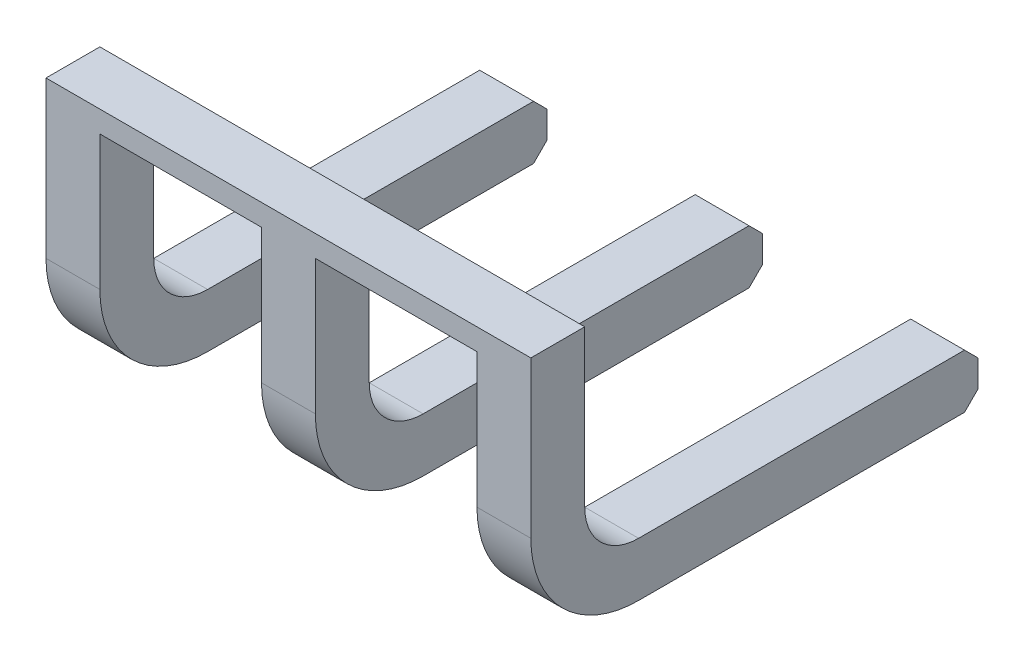
ISO-10303-21;
HEADER;
FILE_DESCRIPTION(('STEP AP214'),'2;1');
FILE_NAME('part.step','',(''),(''),'','','');
FILE_SCHEMA(('AUTOMOTIVE_DESIGN { 1 0 10303 214 1 1 1 1 }'));
ENDSEC;
DATA;
#1=APPLICATION_CONTEXT('core data for automotive mechanical design processes');
#2=APPLICATION_PROTOCOL_DEFINITION('international standard','automotive_design',2000,#1);
#3=PRODUCT_CONTEXT('',#1,'mechanical');
#4=PRODUCT('Part','Part','',(#3));
#5=PRODUCT_RELATED_PRODUCT_CATEGORY('part','',(#4));
#6=PRODUCT_DEFINITION_FORMATION('','',#4);
#7=PRODUCT_DEFINITION_CONTEXT('part definition',#1,'design');
#8=PRODUCT_DEFINITION('design','',#6,#7);
#9=PRODUCT_DEFINITION_SHAPE('','',#8);
#10=(LENGTH_UNIT() NAMED_UNIT(*) SI_UNIT(.MILLI.,.METRE.));
#11=(NAMED_UNIT(*) PLANE_ANGLE_UNIT() SI_UNIT($,.RADIAN.));
#12=(NAMED_UNIT(*) SI_UNIT($,.STERADIAN.) SOLID_ANGLE_UNIT());
#13=UNCERTAINTY_MEASURE_WITH_UNIT(LENGTH_MEASURE(1.E-05),#10,'distance_accuracy_value','');
#14=(GEOMETRIC_REPRESENTATION_CONTEXT(3) GLOBAL_UNCERTAINTY_ASSIGNED_CONTEXT((#13)) GLOBAL_UNIT_ASSIGNED_CONTEXT((#10,
#11,#12)) REPRESENTATION_CONTEXT('',''));
#15=CARTESIAN_POINT('',(0.,0.,0.));
#16=DIRECTION('',(0.,0.,1.));
#17=DIRECTION('',(1.,0.,0.));
#18=AXIS2_PLACEMENT_3D('',#15,#16,#17);
#19=CARTESIAN_POINT('',(2.8575,-0.5715,0.0635));
#20=DIRECTION('',(0.,0.,1.));
#21=DIRECTION('',(0.,1.,0.));
#22=AXIS2_PLACEMENT_3D('',#19,#20,#21);
#23=PLANE('',#22);
#24=DIRECTION('',(-1.,0.,0.));
#25=VECTOR('',#24,1.);
#26=CARTESIAN_POINT('',(2.8575,1.27000000000001,0.0635));
#27=LINE('',#26,#25);
#28=CARTESIAN_POINT('',(-2.8575,1.27000000000001,0.0635));
#29=VERTEX_POINT('',#28);
#30=CARTESIAN_POINT('',(2.8575,1.27000000000001,0.0635));
#31=VERTEX_POINT('',#30);
#32=EDGE_CURVE('E215',#29,#31,#27,.F.);
#33=ORIENTED_EDGE('',*,*,#32,.F.);
#34=DIRECTION('',(0.,-1.,0.));
#35=VECTOR('',#34,1.);
#36=CARTESIAN_POINT('',(-2.8575,1.27000000000001,0.0635));
#37=LINE('',#36,#35);
#38=CARTESIAN_POINT('',(-2.8575,-0.5715,0.0635));
#39=VERTEX_POINT('',#38);
#40=EDGE_CURVE('E230',#29,#39,#37,.T.);
#41=ORIENTED_EDGE('',*,*,#40,.T.);
#42=DIRECTION('',(1.,0.,0.));
#43=VECTOR('',#42,1.);
#44=CARTESIAN_POINT('',(-2.8575,-0.5715,0.0635));
#45=LINE('',#44,#43);
#46=CARTESIAN_POINT('',(-2.2225,-0.571499999999984,0.0635));
#47=VERTEX_POINT('',#46);
#48=EDGE_CURVE('E240',#47,#39,#45,.F.);
#49=ORIENTED_EDGE('',*,*,#48,.F.);
#50=DIRECTION('',(0.,1.,0.));
#51=VECTOR('',#50,1.);
#52=CARTESIAN_POINT('',(-2.2225,-0.571499999999984,0.0635));
#53=LINE('',#52,#51);
#54=CARTESIAN_POINT('',(-2.2225,1.016,0.0635));
#55=VERTEX_POINT('',#54);
#56=EDGE_CURVE('E242',#55,#47,#53,.F.);
#57=ORIENTED_EDGE('',*,*,#56,.F.);
#58=DIRECTION('',(1.,0.,0.));
#59=VECTOR('',#58,1.);
#60=CARTESIAN_POINT('',(-2.2225,1.016,0.0635));
#61=LINE('',#60,#59);
#62=CARTESIAN_POINT('',(-0.3175,1.016,0.0635));
#63=VERTEX_POINT('',#62);
#64=EDGE_CURVE('E252',#63,#55,#61,.F.);
#65=ORIENTED_EDGE('',*,*,#64,.F.);
#66=DIRECTION('',(0.,-1.,0.));
#67=VECTOR('',#66,1.);
#68=CARTESIAN_POINT('',(-0.3175,1.016,0.0635));
#69=LINE('',#68,#67);
#70=CARTESIAN_POINT('',(-0.3175,-0.57149999999997,0.0635));
#71=VERTEX_POINT('',#70);
#72=EDGE_CURVE('E256',#71,#63,#69,.F.);
#73=ORIENTED_EDGE('',*,*,#72,.F.);
#74=DIRECTION('',(1.,0.,0.));
#75=VECTOR('',#74,1.);
#76=CARTESIAN_POINT('',(-0.3175,-0.57149999999997,0.0635));
#77=LINE('',#76,#75);
#78=CARTESIAN_POINT('',(0.3175,-0.571499999999984,0.0635));
#79=VERTEX_POINT('',#78);
#80=EDGE_CURVE('E260',#79,#71,#77,.F.);
#81=ORIENTED_EDGE('',*,*,#80,.F.);
#82=DIRECTION('',(0.,1.,0.));
#83=VECTOR('',#82,1.);
#84=CARTESIAN_POINT('',(0.3175,-0.571499999999984,0.0635));
#85=LINE('',#84,#83);
#86=CARTESIAN_POINT('',(0.3175,1.016,0.0635));
#87=VERTEX_POINT('',#86);
#88=EDGE_CURVE('E265',#87,#79,#85,.F.);
#89=ORIENTED_EDGE('',*,*,#88,.F.);
#90=DIRECTION('',(1.,0.,0.));
#91=VECTOR('',#90,1.);
#92=CARTESIAN_POINT('',(0.3175,1.016,0.0635));
#93=LINE('',#92,#91);
#94=CARTESIAN_POINT('',(2.2225,1.016,0.0635));
#95=VERTEX_POINT('',#94);
#96=EDGE_CURVE('E269',#95,#87,#93,.F.);
#97=ORIENTED_EDGE('',*,*,#96,.F.);
#98=DIRECTION('',(0.,-1.,0.));
#99=VECTOR('',#98,1.);
#100=CARTESIAN_POINT('',(2.2225,1.016,0.0635));
#101=LINE('',#100,#99);
#102=CARTESIAN_POINT('',(2.2225,-0.57149999999997,0.0635));
#103=VERTEX_POINT('',#102);
#104=EDGE_CURVE('E274',#103,#95,#101,.F.);
#105=ORIENTED_EDGE('',*,*,#104,.F.);
#106=DIRECTION('',(1.,0.,0.));
#107=VECTOR('',#106,1.);
#108=CARTESIAN_POINT('',(2.2225,-0.57149999999997,0.0635));
#109=LINE('',#108,#107);
#110=CARTESIAN_POINT('',(2.8575,-0.571499999999984,0.0635));
#111=VERTEX_POINT('',#110);
#112=EDGE_CURVE('E279',#111,#103,#109,.F.);
#113=ORIENTED_EDGE('',*,*,#112,.F.);
#114=DIRECTION('',(0.,1.,0.));
#115=VECTOR('',#114,1.);
#116=CARTESIAN_POINT('',(2.8575,-0.571499999999984,0.0635));
#117=LINE('',#116,#115);
#118=EDGE_CURVE('E233',#31,#111,#117,.F.);
#119=ORIENTED_EDGE('',*,*,#118,.F.);
#120=EDGE_LOOP('',(#33,#41,#49,#57,#65,#73,#81,#89,#97,#105,#113,#119));
#121=FACE_BOUND('',#120,.T.);
#122=ADVANCED_FACE('F16',(#121),#23,.T.);
#123=CARTESIAN_POINT('',(-2.8575,-0.571500000000014,-0.5715));
#124=DIRECTION('',(0.,0.,-1.));
#125=DIRECTION('',(0.,1.,0.));
#126=AXIS2_PLACEMENT_3D('',#123,#124,#125);
#127=PLANE('',#126);
#128=DIRECTION('',(1.,0.,0.));
#129=VECTOR('',#128,1.);
#130=CARTESIAN_POINT('',(-2.8575,1.27000000000001,-0.5715));
#131=LINE('',#130,#129);
#132=CARTESIAN_POINT('',(2.8575,1.27000000000001,-0.5715));
#133=VERTEX_POINT('',#132);
#134=CARTESIAN_POINT('',(-2.8575,1.27000000000001,-0.5715));
#135=VERTEX_POINT('',#134);
#136=EDGE_CURVE('E218',#133,#135,#131,.F.);
#137=ORIENTED_EDGE('',*,*,#136,.F.);
#138=DIRECTION('',(0.,-1.,0.));
#139=VECTOR('',#138,1.);
#140=CARTESIAN_POINT('',(2.8575,1.27000000000001,-0.5715));
#141=LINE('',#140,#139);
#142=CARTESIAN_POINT('',(2.8575,-0.5715,-0.5715));
#143=VERTEX_POINT('',#142);
#144=EDGE_CURVE('E290',#143,#133,#141,.F.);
#145=ORIENTED_EDGE('',*,*,#144,.F.);
#146=DIRECTION('',(-1.,0.,0.));
#147=VECTOR('',#146,1.);
#148=CARTESIAN_POINT('',(2.8575,-0.5715,-0.5715));
#149=LINE('',#148,#147);
#150=CARTESIAN_POINT('',(2.2225,-0.571500000000014,-0.5715));
#151=VERTEX_POINT('',#150);
#152=EDGE_CURVE('E295',#143,#151,#149,.T.);
#153=ORIENTED_EDGE('',*,*,#152,.T.);
#154=DIRECTION('',(0.,1.,0.));
#155=VECTOR('',#154,1.);
#156=CARTESIAN_POINT('',(2.2225,-0.571500000000014,-0.5715));
#157=LINE('',#156,#155);
#158=CARTESIAN_POINT('',(2.2225,1.016,-0.5715));
#159=VERTEX_POINT('',#158);
#160=EDGE_CURVE('E300',#159,#151,#157,.F.);
#161=ORIENTED_EDGE('',*,*,#160,.F.);
#162=DIRECTION('',(-1.,0.,0.));
#163=VECTOR('',#162,1.);
#164=CARTESIAN_POINT('',(2.2225,1.016,-0.5715));
#165=LINE('',#164,#163);
#166=CARTESIAN_POINT('',(0.3175,1.016,-0.5715));
#167=VERTEX_POINT('',#166);
#168=EDGE_CURVE('E304',#167,#159,#165,.F.);
#169=ORIENTED_EDGE('',*,*,#168,.F.);
#170=DIRECTION('',(0.,-1.,0.));
#171=VECTOR('',#170,1.);
#172=CARTESIAN_POINT('',(0.3175,1.016,-0.5715));
#173=LINE('',#172,#171);
#174=CARTESIAN_POINT('',(0.3175,-0.5715,-0.5715));
#175=VERTEX_POINT('',#174);
#176=EDGE_CURVE('E308',#175,#167,#173,.F.);
#177=ORIENTED_EDGE('',*,*,#176,.F.);
#178=DIRECTION('',(-1.,0.,0.));
#179=VECTOR('',#178,1.);
#180=CARTESIAN_POINT('',(0.3175,-0.5715,-0.5715));
#181=LINE('',#180,#179);
#182=CARTESIAN_POINT('',(-0.3175,-0.571500000000013,-0.5715));
#183=VERTEX_POINT('',#182);
#184=EDGE_CURVE('E312',#175,#183,#181,.T.);
#185=ORIENTED_EDGE('',*,*,#184,.T.);
#186=DIRECTION('',(0.,1.,0.));
#187=VECTOR('',#186,1.);
#188=CARTESIAN_POINT('',(-0.3175,-0.571500000000013,-0.5715));
#189=LINE('',#188,#187);
#190=CARTESIAN_POINT('',(-0.3175,1.016,-0.5715));
#191=VERTEX_POINT('',#190);
#192=EDGE_CURVE('E317',#191,#183,#189,.F.);
#193=ORIENTED_EDGE('',*,*,#192,.F.);
#194=DIRECTION('',(-1.,0.,0.));
#195=VECTOR('',#194,1.);
#196=CARTESIAN_POINT('',(-0.3175,1.016,-0.5715));
#197=LINE('',#196,#195);
#198=CARTESIAN_POINT('',(-2.2225,1.016,-0.5715));
#199=VERTEX_POINT('',#198);
#200=EDGE_CURVE('E321',#199,#191,#197,.F.);
#201=ORIENTED_EDGE('',*,*,#200,.F.);
#202=DIRECTION('',(0.,-1.,0.));
#203=VECTOR('',#202,1.);
#204=CARTESIAN_POINT('',(-2.2225,1.016,-0.5715));
#205=LINE('',#204,#203);
#206=CARTESIAN_POINT('',(-2.2225,-0.5715,-0.5715));
#207=VERTEX_POINT('',#206);
#208=EDGE_CURVE('E326',#207,#199,#205,.F.);
#209=ORIENTED_EDGE('',*,*,#208,.F.);
#210=DIRECTION('',(-1.,0.,0.));
#211=VECTOR('',#210,1.);
#212=CARTESIAN_POINT('',(-2.2225,-0.5715,-0.5715));
#213=LINE('',#212,#211);
#214=CARTESIAN_POINT('',(-2.8575,-0.571500000000013,-0.5715));
#215=VERTEX_POINT('',#214);
#216=EDGE_CURVE('E331',#207,#215,#213,.T.);
#217=ORIENTED_EDGE('',*,*,#216,.T.);
#218=DIRECTION('',(0.,1.,0.));
#219=VECTOR('',#218,1.);
#220=CARTESIAN_POINT('',(-2.8575,-0.571500000000013,-0.5715));
#221=LINE('',#220,#219);
#222=EDGE_CURVE('E336',#215,#135,#221,.T.);
#223=ORIENTED_EDGE('',*,*,#222,.T.);
#224=EDGE_LOOP('',(#137,#145,#153,#161,#169,#177,#185,#193,#201,#209,#217,#223));
#225=FACE_BOUND('',#224,.T.);
#226=ADVANCED_FACE('F632',(#225),#127,.T.);
#227=CARTESIAN_POINT('',(2.8575,-1.8415,0.0635000000000001));
#228=DIRECTION('',(1.,0.,0.));
#229=DIRECTION('',(0.,0.,-1.));
#230=AXIS2_PLACEMENT_3D('',#227,#228,#229);
#231=PLANE('',#230);
#232=ORIENTED_EDGE('',*,*,#144,.T.);
#233=DIRECTION('',(0.,0.,1.));
#234=VECTOR('',#233,1.);
#235=CARTESIAN_POINT('',(2.8575,1.27000000000001,-0.571499999999993));
#236=LINE('',#235,#234);
#237=EDGE_CURVE('E340',#133,#31,#236,.T.);
#238=ORIENTED_EDGE('',*,*,#237,.T.);
#239=ORIENTED_EDGE('',*,*,#118,.T.);
#240=CARTESIAN_POINT('',(2.8575,-0.571499999999968,-1.20650000000003));
#241=DIRECTION('',(1.,0.,0.));
#242=DIRECTION('',(0.,0.,1.));
#243=AXIS2_PLACEMENT_3D('',#240,#241,#242);
#244=CIRCLE('',#243,1.27000000000003);
#245=CARTESIAN_POINT('',(2.8575,-1.8415,-1.2065));
#246=VERTEX_POINT('',#245);
#247=EDGE_CURVE('E344',#111,#246,#244,.T.);
#248=ORIENTED_EDGE('',*,*,#247,.T.);
#249=DIRECTION('',(0.,0.,-1.));
#250=VECTOR('',#249,1.);
#251=CARTESIAN_POINT('',(2.8575,-1.8415,-1.2065));
#252=LINE('',#251,#250);
#253=CARTESIAN_POINT('',(2.8575,-1.8415,-5.04825));
#254=VERTEX_POINT('',#253);
#255=EDGE_CURVE('E349',#246,#254,#252,.T.);
#256=ORIENTED_EDGE('',*,*,#255,.T.);
#257=DIRECTION('',(0.,0.707106781186551,-0.707106781186544));
#258=VECTOR('',#257,1.);
#259=CARTESIAN_POINT('',(2.8575,-1.8415,-5.04825));
#260=LINE('',#259,#258);
#261=CARTESIAN_POINT('',(2.8575,-1.68275,-5.207));
#262=VERTEX_POINT('',#261);
#263=EDGE_CURVE('E354',#254,#262,#260,.T.);
#264=ORIENTED_EDGE('',*,*,#263,.T.);
#265=DIRECTION('',(0.,1.,0.));
#266=VECTOR('',#265,1.);
#267=CARTESIAN_POINT('',(2.8575,-1.68275,-5.207));
#268=LINE('',#267,#266);
#269=CARTESIAN_POINT('',(2.8575,-1.36525,-5.207));
#270=VERTEX_POINT('',#269);
#271=EDGE_CURVE('E359',#262,#270,#268,.T.);
#272=ORIENTED_EDGE('',*,*,#271,.T.);
#273=DIRECTION('',(0.,0.707106781186551,0.707106781186545));
#274=VECTOR('',#273,1.);
#275=CARTESIAN_POINT('',(2.8575,-1.36525,-5.207));
#276=LINE('',#275,#274);
#277=CARTESIAN_POINT('',(2.8575,-1.2065,-5.04825));
#278=VERTEX_POINT('',#277);
#279=EDGE_CURVE('E364',#270,#278,#276,.T.);
#280=ORIENTED_EDGE('',*,*,#279,.T.);
#281=DIRECTION('',(0.,0.,1.));
#282=VECTOR('',#281,1.);
#283=CARTESIAN_POINT('',(2.8575,-1.2065,-5.04825));
#284=LINE('',#283,#282);
#285=CARTESIAN_POINT('',(2.8575,-1.2065,-1.20649999999999));
#286=VERTEX_POINT('',#285);
#287=EDGE_CURVE('E369',#278,#286,#284,.T.);
#288=ORIENTED_EDGE('',*,*,#287,.T.);
#289=CARTESIAN_POINT('',(2.8575,-0.571500000000027,-1.20649999999997));
#290=DIRECTION('',(-1.,0.,0.));
#291=DIRECTION('',(0.,-1.,0.));
#292=AXIS2_PLACEMENT_3D('',#289,#290,#291);
#293=CIRCLE('',#292,0.634999999999973);
#294=EDGE_CURVE('E224',#143,#286,#293,.F.);
#295=ORIENTED_EDGE('',*,*,#294,.F.);
#296=EDGE_LOOP('',(#232,#238,#239,#248,#256,#264,#272,#280,#288,#295));
#297=FACE_BOUND('',#296,.T.);
#298=ADVANCED_FACE('F640',(#297),#231,.T.);
#299=CARTESIAN_POINT('',(-2.8575,-1.8415,0.0635000000000001));
#300=DIRECTION('',(-1.,0.,0.));
#301=DIRECTION('',(0.,1.,0.));
#302=AXIS2_PLACEMENT_3D('',#299,#300,#301);
#303=PLANE('',#302);
#304=DIRECTION('',(0.,0.,-1.));
#305=VECTOR('',#304,1.);
#306=CARTESIAN_POINT('',(-2.8575,1.27000000000001,0.0635000000000001));
#307=LINE('',#306,#305);
#308=EDGE_CURVE('E213',#135,#29,#307,.F.);
#309=ORIENTED_EDGE('',*,*,#308,.F.);
#310=ORIENTED_EDGE('',*,*,#222,.F.);
#311=CARTESIAN_POINT('',(-2.8575,-0.571500000000027,-1.20649999999997));
#312=DIRECTION('',(1.,0.,0.));
#313=DIRECTION('',(0.,0.,1.));
#314=AXIS2_PLACEMENT_3D('',#311,#312,#313);
#315=CIRCLE('',#314,0.634999999999973);
#316=CARTESIAN_POINT('',(-2.8575,-1.2065,-1.20649999999999));
#317=VERTEX_POINT('',#316);
#318=EDGE_CURVE('E223',#215,#317,#315,.T.);
#319=ORIENTED_EDGE('',*,*,#318,.T.);
#320=DIRECTION('',(0.,0.,-1.));
#321=VECTOR('',#320,1.);
#322=CARTESIAN_POINT('',(-2.8575,-1.2065,-1.20649999999999));
#323=LINE('',#322,#321);
#324=CARTESIAN_POINT('',(-2.8575,-1.2065,-5.04825));
#325=VERTEX_POINT('',#324);
#326=EDGE_CURVE('E383',#325,#317,#323,.F.);
#327=ORIENTED_EDGE('',*,*,#326,.F.);
#328=DIRECTION('',(0.,-0.707106781186551,-0.707106781186544));
#329=VECTOR('',#328,1.);
#330=CARTESIAN_POINT('',(-2.8575,-1.2065,-5.04825));
#331=LINE('',#330,#329);
#332=CARTESIAN_POINT('',(-2.8575,-1.36525,-5.207));
#333=VERTEX_POINT('',#332);
#334=EDGE_CURVE('E388',#333,#325,#331,.F.);
#335=ORIENTED_EDGE('',*,*,#334,.F.);
#336=DIRECTION('',(0.,-1.,0.));
#337=VECTOR('',#336,1.);
#338=CARTESIAN_POINT('',(-2.8575,-1.36525,-5.207));
#339=LINE('',#338,#337);
#340=CARTESIAN_POINT('',(-2.8575,-1.68275,-5.207));
#341=VERTEX_POINT('',#340);
#342=EDGE_CURVE('E393',#341,#333,#339,.F.);
#343=ORIENTED_EDGE('',*,*,#342,.F.);
#344=DIRECTION('',(0.,-0.707106781186551,0.707106781186544));
#345=VECTOR('',#344,1.);
#346=CARTESIAN_POINT('',(-2.8575,-1.68275,-5.207));
#347=LINE('',#346,#345);
#348=CARTESIAN_POINT('',(-2.8575,-1.8415,-5.04825));
#349=VERTEX_POINT('',#348);
#350=EDGE_CURVE('E398',#349,#341,#347,.F.);
#351=ORIENTED_EDGE('',*,*,#350,.F.);
#352=DIRECTION('',(0.,0.,1.));
#353=VECTOR('',#352,1.);
#354=CARTESIAN_POINT('',(-2.8575,-1.8415,-5.04825));
#355=LINE('',#354,#353);
#356=CARTESIAN_POINT('',(-2.8575,-1.8415,-1.2065));
#357=VERTEX_POINT('',#356);
#358=EDGE_CURVE('E403',#357,#349,#355,.F.);
#359=ORIENTED_EDGE('',*,*,#358,.F.);
#360=CARTESIAN_POINT('',(-2.8575,-0.571499999999968,-1.20650000000003));
#361=DIRECTION('',(-1.,0.,0.));
#362=DIRECTION('',(0.,-1.,0.));
#363=AXIS2_PLACEMENT_3D('',#360,#361,#362);
#364=CIRCLE('',#363,1.27000000000003);
#365=EDGE_CURVE('E239',#39,#357,#364,.F.);
#366=ORIENTED_EDGE('',*,*,#365,.F.);
#367=ORIENTED_EDGE('',*,*,#40,.F.);
#368=EDGE_LOOP('',(#309,#310,#319,#327,#335,#343,#351,#359,#366,#367));
#369=FACE_BOUND('',#368,.T.);
#370=ADVANCED_FACE('F236',(#369),#303,.T.);
#371=CARTESIAN_POINT('',(2.8575,-0.571499999999968,-1.20650000000003));
#372=DIRECTION('',(-1.,0.,0.));
#373=DIRECTION('',(0.,-1.,0.));
#374=AXIS2_PLACEMENT_3D('',#371,#372,#373);
#375=CYLINDRICAL_SURFACE('',#374,1.27000000000003);
#376=CARTESIAN_POINT('',(2.2225,-0.571499999999968,-1.20650000000003));
#377=DIRECTION('',(1.,0.,0.));
#378=DIRECTION('',(0.,0.,1.));
#379=AXIS2_PLACEMENT_3D('',#376,#377,#378);
#380=CIRCLE('',#379,1.27000000000003);
#381=CARTESIAN_POINT('',(2.2225,-1.8415,-1.2065));
#382=VERTEX_POINT('',#381);
#383=EDGE_CURVE('E411',#382,#103,#380,.F.);
#384=ORIENTED_EDGE('',*,*,#383,.F.);
#385=DIRECTION('',(1.,0.,0.));
#386=VECTOR('',#385,1.);
#387=CARTESIAN_POINT('',(2.2225,-1.8415,-1.2065));
#388=LINE('',#387,#386);
#389=EDGE_CURVE('E415',#246,#382,#388,.F.);
#390=ORIENTED_EDGE('',*,*,#389,.F.);
#391=ORIENTED_EDGE('',*,*,#247,.F.);
#392=ORIENTED_EDGE('',*,*,#112,.T.);
#393=EDGE_LOOP('',(#384,#390,#391,#392));
#394=FACE_BOUND('',#393,.T.);
#395=ADVANCED_FACE('F662',(#394),#375,.T.);
#396=CARTESIAN_POINT('',(2.8575,-0.571499999999968,-1.20650000000003));
#397=DIRECTION('',(-1.,0.,0.));
#398=DIRECTION('',(0.,-1.,0.));
#399=AXIS2_PLACEMENT_3D('',#396,#397,#398);
#400=CYLINDRICAL_SURFACE('',#399,1.27000000000003);
#401=CARTESIAN_POINT('',(0.3175,-0.571499999999968,-1.20650000000003));
#402=DIRECTION('',(-1.,0.,0.));
#403=DIRECTION('',(0.,-1.,0.));
#404=AXIS2_PLACEMENT_3D('',#401,#402,#403);
#405=CIRCLE('',#404,1.27000000000003);
#406=CARTESIAN_POINT('',(0.3175,-1.8415,-1.2065));
#407=VERTEX_POINT('',#406);
#408=EDGE_CURVE('E420',#79,#407,#405,.F.);
#409=ORIENTED_EDGE('',*,*,#408,.F.);
#410=ORIENTED_EDGE('',*,*,#80,.T.);
#411=CARTESIAN_POINT('',(-0.3175,-0.571499999999968,-1.20650000000003));
#412=DIRECTION('',(1.,0.,0.));
#413=DIRECTION('',(0.,0.,1.));
#414=AXIS2_PLACEMENT_3D('',#411,#412,#413);
#415=CIRCLE('',#414,1.27000000000003);
#416=CARTESIAN_POINT('',(-0.3175,-1.8415,-1.2065));
#417=VERTEX_POINT('',#416);
#418=EDGE_CURVE('E424',#417,#71,#415,.F.);
#419=ORIENTED_EDGE('',*,*,#418,.F.);
#420=DIRECTION('',(1.,0.,0.));
#421=VECTOR('',#420,1.);
#422=CARTESIAN_POINT('',(-0.3175,-1.8415,-1.2065));
#423=LINE('',#422,#421);
#424=EDGE_CURVE('E428',#407,#417,#423,.F.);
#425=ORIENTED_EDGE('',*,*,#424,.F.);
#426=EDGE_LOOP('',(#409,#410,#419,#425));
#427=FACE_BOUND('',#426,.T.);
#428=ADVANCED_FACE('F699',(#427),#400,.T.);
#429=CARTESIAN_POINT('',(2.8575,-0.571499999999968,-1.20650000000003));
#430=DIRECTION('',(-1.,0.,0.));
#431=DIRECTION('',(0.,-1.,0.));
#432=AXIS2_PLACEMENT_3D('',#429,#430,#431);
#433=CYLINDRICAL_SURFACE('',#432,1.27000000000003);
#434=CARTESIAN_POINT('',(-2.2225,-0.571499999999968,-1.20650000000003));
#435=DIRECTION('',(-1.,0.,0.));
#436=DIRECTION('',(0.,-1.,0.));
#437=AXIS2_PLACEMENT_3D('',#434,#435,#436);
#438=CIRCLE('',#437,1.27000000000003);
#439=CARTESIAN_POINT('',(-2.2225,-1.8415,-1.2065));
#440=VERTEX_POINT('',#439);
#441=EDGE_CURVE('E433',#47,#440,#438,.F.);
#442=ORIENTED_EDGE('',*,*,#441,.F.);
#443=ORIENTED_EDGE('',*,*,#48,.T.);
#444=ORIENTED_EDGE('',*,*,#365,.T.);
#445=DIRECTION('',(1.,0.,0.));
#446=VECTOR('',#445,1.);
#447=CARTESIAN_POINT('',(-2.8575,-1.8415,-1.2065));
#448=LINE('',#447,#446);
#449=EDGE_CURVE('E437',#440,#357,#448,.F.);
#450=ORIENTED_EDGE('',*,*,#449,.F.);
#451=EDGE_LOOP('',(#442,#443,#444,#450));
#452=FACE_BOUND('',#451,.T.);
#453=ADVANCED_FACE('F738',(#452),#433,.T.);
#454=CARTESIAN_POINT('',(2.2225,-1.8415,-5.04825));
#455=DIRECTION('',(0.,-1.,0.));
#456=DIRECTION('',(1.,0.,0.));
#457=AXIS2_PLACEMENT_3D('',#454,#455,#456);
#458=PLANE('',#457);
#459=DIRECTION('',(0.,0.,-1.));
#460=VECTOR('',#459,1.);
#461=CARTESIAN_POINT('',(2.2225,-1.8415,-1.2065));
#462=LINE('',#461,#460);
#463=CARTESIAN_POINT('',(2.2225,-1.8415,-5.04825));
#464=VERTEX_POINT('',#463);
#465=EDGE_CURVE('E441',#464,#382,#462,.F.);
#466=ORIENTED_EDGE('',*,*,#465,.F.);
#467=DIRECTION('',(1.,0.,0.));
#468=VECTOR('',#467,1.);
#469=CARTESIAN_POINT('',(2.2225,-1.8415,-5.04825));
#470=LINE('',#469,#468);
#471=EDGE_CURVE('E445',#254,#464,#470,.F.);
#472=ORIENTED_EDGE('',*,*,#471,.F.);
#473=ORIENTED_EDGE('',*,*,#255,.F.);
#474=ORIENTED_EDGE('',*,*,#389,.T.);
#475=EDGE_LOOP('',(#466,#472,#473,#474));
#476=FACE_BOUND('',#475,.T.);
#477=ADVANCED_FACE('F659',(#476),#458,.T.);
#478=CARTESIAN_POINT('',(-0.3175,-1.8415,-5.04825));
#479=DIRECTION('',(0.,-1.,0.));
#480=DIRECTION('',(1.,0.,0.));
#481=AXIS2_PLACEMENT_3D('',#478,#479,#480);
#482=PLANE('',#481);
#483=DIRECTION('',(0.,0.,1.));
#484=VECTOR('',#483,1.);
#485=CARTESIAN_POINT('',(0.3175,-1.8415,-5.04825));
#486=LINE('',#485,#484);
#487=CARTESIAN_POINT('',(0.3175,-1.8415,-5.04825));
#488=VERTEX_POINT('',#487);
#489=EDGE_CURVE('E450',#407,#488,#486,.F.);
#490=ORIENTED_EDGE('',*,*,#489,.F.);
#491=ORIENTED_EDGE('',*,*,#424,.T.);
#492=DIRECTION('',(0.,0.,-1.));
#493=VECTOR('',#492,1.);
#494=CARTESIAN_POINT('',(-0.3175,-1.8415,-1.2065));
#495=LINE('',#494,#493);
#496=CARTESIAN_POINT('',(-0.3175,-1.8415,-5.04825));
#497=VERTEX_POINT('',#496);
#498=EDGE_CURVE('E454',#497,#417,#495,.F.);
#499=ORIENTED_EDGE('',*,*,#498,.F.);
#500=DIRECTION('',(1.,0.,0.));
#501=VECTOR('',#500,1.);
#502=CARTESIAN_POINT('',(-0.3175,-1.8415,-5.04825));
#503=LINE('',#502,#501);
#504=EDGE_CURVE('E458',#488,#497,#503,.F.);
#505=ORIENTED_EDGE('',*,*,#504,.F.);
#506=EDGE_LOOP('',(#490,#491,#499,#505));
#507=FACE_BOUND('',#506,.T.);
#508=ADVANCED_FACE('F696',(#507),#482,.T.);
#509=CARTESIAN_POINT('',(-2.8575,-1.8415,-5.04825));
#510=DIRECTION('',(0.,-1.,0.));
#511=DIRECTION('',(1.,0.,0.));
#512=AXIS2_PLACEMENT_3D('',#509,#510,#511);
#513=PLANE('',#512);
#514=DIRECTION('',(0.,0.,1.));
#515=VECTOR('',#514,1.);
#516=CARTESIAN_POINT('',(-2.2225,-1.8415,-5.04825));
#517=LINE('',#516,#515);
#518=CARTESIAN_POINT('',(-2.2225,-1.8415,-5.04825));
#519=VERTEX_POINT('',#518);
#520=EDGE_CURVE('E463',#440,#519,#517,.F.);
#521=ORIENTED_EDGE('',*,*,#520,.F.);
#522=ORIENTED_EDGE('',*,*,#449,.T.);
#523=ORIENTED_EDGE('',*,*,#358,.T.);
#524=DIRECTION('',(1.,0.,0.));
#525=VECTOR('',#524,1.);
#526=CARTESIAN_POINT('',(-2.8575,-1.8415,-5.04825));
#527=LINE('',#526,#525);
#528=EDGE_CURVE('E467',#519,#349,#527,.F.);
#529=ORIENTED_EDGE('',*,*,#528,.F.);
#530=EDGE_LOOP('',(#521,#522,#523,#529));
#531=FACE_BOUND('',#530,.T.);
#532=ADVANCED_FACE('F735',(#531),#513,.T.);
#533=CARTESIAN_POINT('',(2.2225,-1.68275,-5.207));
#534=DIRECTION('',(0.,-0.707106781186548,-0.707106781186547));
#535=DIRECTION('',(1.,0.,0.));
#536=AXIS2_PLACEMENT_3D('',#533,#534,#535);
#537=PLANE('',#536);
#538=DIRECTION('',(0.,0.707106781186548,-0.707106781186548));
#539=VECTOR('',#538,1.);
#540=CARTESIAN_POINT('',(2.2225,-1.8415,-5.04825));
#541=LINE('',#540,#539);
#542=CARTESIAN_POINT('',(2.2225,-1.68275,-5.207));
#543=VERTEX_POINT('',#542);
#544=EDGE_CURVE('E471',#543,#464,#541,.F.);
#545=ORIENTED_EDGE('',*,*,#544,.F.);
#546=DIRECTION('',(1.,0.,0.));
#547=VECTOR('',#546,1.);
#548=CARTESIAN_POINT('',(2.2225,-1.68275,-5.207));
#549=LINE('',#548,#547);
#550=EDGE_CURVE('E475',#262,#543,#549,.F.);
#551=ORIENTED_EDGE('',*,*,#550,.F.);
#552=ORIENTED_EDGE('',*,*,#263,.F.);
#553=ORIENTED_EDGE('',*,*,#471,.T.);
#554=EDGE_LOOP('',(#545,#551,#552,#553));
#555=FACE_BOUND('',#554,.T.);
#556=ADVANCED_FACE('F654',(#555),#537,.T.);
#557=CARTESIAN_POINT('',(-0.3175,-1.68275,-5.207));
#558=DIRECTION('',(0.,-0.707106781186548,-0.707106781186547));
#559=DIRECTION('',(1.,0.,0.));
#560=AXIS2_PLACEMENT_3D('',#557,#558,#559);
#561=PLANE('',#560);
#562=DIRECTION('',(0.,-0.707106781186547,0.707106781186548));
#563=VECTOR('',#562,1.);
#564=CARTESIAN_POINT('',(0.3175,-1.68275,-5.207));
#565=LINE('',#564,#563);
#566=CARTESIAN_POINT('',(0.3175,-1.68275,-5.207));
#567=VERTEX_POINT('',#566);
#568=EDGE_CURVE('E480',#488,#567,#565,.F.);
#569=ORIENTED_EDGE('',*,*,#568,.F.);
#570=ORIENTED_EDGE('',*,*,#504,.T.);
#571=DIRECTION('',(0.,0.707106781186548,-0.707106781186548));
#572=VECTOR('',#571,1.);
#573=CARTESIAN_POINT('',(-0.3175,-1.8415,-5.04825));
#574=LINE('',#573,#572);
#575=CARTESIAN_POINT('',(-0.3175,-1.68275,-5.207));
#576=VERTEX_POINT('',#575);
#577=EDGE_CURVE('E484',#576,#497,#574,.F.);
#578=ORIENTED_EDGE('',*,*,#577,.F.);
#579=DIRECTION('',(1.,0.,0.));
#580=VECTOR('',#579,1.);
#581=CARTESIAN_POINT('',(-0.3175,-1.68275,-5.207));
#582=LINE('',#581,#580);
#583=EDGE_CURVE('E488',#567,#576,#582,.F.);
#584=ORIENTED_EDGE('',*,*,#583,.F.);
#585=EDGE_LOOP('',(#569,#570,#578,#584));
#586=FACE_BOUND('',#585,.T.);
#587=ADVANCED_FACE('F690',(#586),#561,.T.);
#588=CARTESIAN_POINT('',(-2.8575,-1.68275,-5.207));
#589=DIRECTION('',(0.,-0.707106781186548,-0.707106781186547));
#590=DIRECTION('',(1.,0.,0.));
#591=AXIS2_PLACEMENT_3D('',#588,#589,#590);
#592=PLANE('',#591);
#593=DIRECTION('',(0.,-0.707106781186547,0.707106781186548));
#594=VECTOR('',#593,1.);
#595=CARTESIAN_POINT('',(-2.2225,-1.68275,-5.207));
#596=LINE('',#595,#594);
#597=CARTESIAN_POINT('',(-2.2225,-1.68275,-5.207));
#598=VERTEX_POINT('',#597);
#599=EDGE_CURVE('E493',#519,#598,#596,.F.);
#600=ORIENTED_EDGE('',*,*,#599,.F.);
#601=ORIENTED_EDGE('',*,*,#528,.T.);
#602=ORIENTED_EDGE('',*,*,#350,.T.);
#603=DIRECTION('',(1.,0.,0.));
#604=VECTOR('',#603,1.);
#605=CARTESIAN_POINT('',(-2.8575,-1.68275,-5.207));
#606=LINE('',#605,#604);
#607=EDGE_CURVE('E497',#598,#341,#606,.F.);
#608=ORIENTED_EDGE('',*,*,#607,.F.);
#609=EDGE_LOOP('',(#600,#601,#602,#608));
#610=FACE_BOUND('',#609,.T.);
#611=ADVANCED_FACE('F731',(#610),#592,.T.);
#612=CARTESIAN_POINT('',(2.2225,-1.68275,-5.207));
#613=DIRECTION('',(0.,0.,-1.));
#614=DIRECTION('',(0.,1.,0.));
#615=AXIS2_PLACEMENT_3D('',#612,#613,#614);
#616=PLANE('',#615);
#617=DIRECTION('',(0.,1.,0.));
#618=VECTOR('',#617,1.);
#619=CARTESIAN_POINT('',(2.2225,-1.68275,-5.207));
#620=LINE('',#619,#618);
#621=CARTESIAN_POINT('',(2.2225,-1.36525,-5.207));
#622=VERTEX_POINT('',#621);
#623=EDGE_CURVE('E501',#543,#622,#620,.T.);
#624=ORIENTED_EDGE('',*,*,#623,.T.);
#625=DIRECTION('',(1.,0.,0.));
#626=VECTOR('',#625,1.);
#627=CARTESIAN_POINT('',(2.2225,-1.36525,-5.207));
#628=LINE('',#627,#626);
#629=EDGE_CURVE('E506',#270,#622,#628,.F.);
#630=ORIENTED_EDGE('',*,*,#629,.F.);
#631=ORIENTED_EDGE('',*,*,#271,.F.);
#632=ORIENTED_EDGE('',*,*,#550,.T.);
#633=EDGE_LOOP('',(#624,#630,#631,#632));
#634=FACE_BOUND('',#633,.T.);
#635=ADVANCED_FACE('F651',(#634),#616,.T.);
#636=CARTESIAN_POINT('',(-0.3175,-1.68275,-5.207));
#637=DIRECTION('',(0.,0.,-1.));
#638=DIRECTION('',(0.,1.,0.));
#639=AXIS2_PLACEMENT_3D('',#636,#637,#638);
#640=PLANE('',#639);
#641=DIRECTION('',(0.,-1.,0.));
#642=VECTOR('',#641,1.);
#643=CARTESIAN_POINT('',(0.3175,-1.36525,-5.207));
#644=LINE('',#643,#642);
#645=CARTESIAN_POINT('',(0.3175,-1.36525,-5.207));
#646=VERTEX_POINT('',#645);
#647=EDGE_CURVE('E511',#646,#567,#644,.T.);
#648=ORIENTED_EDGE('',*,*,#647,.T.);
#649=ORIENTED_EDGE('',*,*,#583,.T.);
#650=DIRECTION('',(0.,1.,0.));
#651=VECTOR('',#650,1.);
#652=CARTESIAN_POINT('',(-0.3175,-1.68275,-5.207));
#653=LINE('',#652,#651);
#654=CARTESIAN_POINT('',(-0.3175,-1.36525,-5.207));
#655=VERTEX_POINT('',#654);
#656=EDGE_CURVE('E516',#576,#655,#653,.T.);
#657=ORIENTED_EDGE('',*,*,#656,.T.);
#658=DIRECTION('',(1.,0.,0.));
#659=VECTOR('',#658,1.);
#660=CARTESIAN_POINT('',(-0.3175,-1.36525,-5.207));
#661=LINE('',#660,#659);
#662=EDGE_CURVE('E521',#646,#655,#661,.F.);
#663=ORIENTED_EDGE('',*,*,#662,.F.);
#664=EDGE_LOOP('',(#648,#649,#657,#663));
#665=FACE_BOUND('',#664,.T.);
#666=ADVANCED_FACE('F686',(#665),#640,.T.);
#667=CARTESIAN_POINT('',(-2.8575,-1.68275,-5.207));
#668=DIRECTION('',(0.,0.,-1.));
#669=DIRECTION('',(0.,1.,0.));
#670=AXIS2_PLACEMENT_3D('',#667,#668,#669);
#671=PLANE('',#670);
#672=DIRECTION('',(0.,-1.,0.));
#673=VECTOR('',#672,1.);
#674=CARTESIAN_POINT('',(-2.2225,-1.36525,-5.207));
#675=LINE('',#674,#673);
#676=CARTESIAN_POINT('',(-2.2225,-1.36525,-5.207));
#677=VERTEX_POINT('',#676);
#678=EDGE_CURVE('E526',#677,#598,#675,.T.);
#679=ORIENTED_EDGE('',*,*,#678,.T.);
#680=ORIENTED_EDGE('',*,*,#607,.T.);
#681=ORIENTED_EDGE('',*,*,#342,.T.);
#682=DIRECTION('',(1.,0.,0.));
#683=VECTOR('',#682,1.);
#684=CARTESIAN_POINT('',(-2.8575,-1.36525,-5.207));
#685=LINE('',#684,#683);
#686=EDGE_CURVE('E531',#677,#333,#685,.F.);
#687=ORIENTED_EDGE('',*,*,#686,.F.);
#688=EDGE_LOOP('',(#679,#680,#681,#687));
#689=FACE_BOUND('',#688,.T.);
#690=ADVANCED_FACE('F727',(#689),#671,.T.);
#691=CARTESIAN_POINT('',(2.2225,-1.2065,-5.04825));
#692=DIRECTION('',(0.,0.707106781186548,-0.707106781186548));
#693=DIRECTION('',(1.,0.,0.));
#694=AXIS2_PLACEMENT_3D('',#691,#692,#693);
#695=PLANE('',#694);
#696=DIRECTION('',(0.,0.707106781186547,0.707106781186548));
#697=VECTOR('',#696,1.);
#698=CARTESIAN_POINT('',(2.2225,-1.36525,-5.207));
#699=LINE('',#698,#697);
#700=CARTESIAN_POINT('',(2.2225,-1.2065,-5.04825));
#701=VERTEX_POINT('',#700);
#702=EDGE_CURVE('E535',#701,#622,#699,.F.);
#703=ORIENTED_EDGE('',*,*,#702,.F.);
#704=DIRECTION('',(1.,0.,0.));
#705=VECTOR('',#704,1.);
#706=CARTESIAN_POINT('',(2.2225,-1.2065,-5.04825));
#707=LINE('',#706,#705);
#708=EDGE_CURVE('E539',#278,#701,#707,.F.);
#709=ORIENTED_EDGE('',*,*,#708,.F.);
#710=ORIENTED_EDGE('',*,*,#279,.F.);
#711=ORIENTED_EDGE('',*,*,#629,.T.);
#712=EDGE_LOOP('',(#703,#709,#710,#711));
#713=FACE_BOUND('',#712,.T.);
#714=ADVANCED_FACE('F647',(#713),#695,.T.);
#715=CARTESIAN_POINT('',(-0.3175,-1.2065,-5.04825));
#716=DIRECTION('',(0.,0.707106781186548,-0.707106781186548));
#717=DIRECTION('',(1.,0.,0.));
#718=AXIS2_PLACEMENT_3D('',#715,#716,#717);
#719=PLANE('',#718);
#720=DIRECTION('',(0.,-0.707106781186548,-0.707106781186548));
#721=VECTOR('',#720,1.);
#722=CARTESIAN_POINT('',(0.3175,-1.2065,-5.04825));
#723=LINE('',#722,#721);
#724=CARTESIAN_POINT('',(0.3175,-1.2065,-5.04825));
#725=VERTEX_POINT('',#724);
#726=EDGE_CURVE('E544',#646,#725,#723,.F.);
#727=ORIENTED_EDGE('',*,*,#726,.F.);
#728=ORIENTED_EDGE('',*,*,#662,.T.);
#729=DIRECTION('',(0.,0.707106781186547,0.707106781186548));
#730=VECTOR('',#729,1.);
#731=CARTESIAN_POINT('',(-0.3175,-1.36525,-5.207));
#732=LINE('',#731,#730);
#733=CARTESIAN_POINT('',(-0.3175,-1.2065,-5.04825));
#734=VERTEX_POINT('',#733);
#735=EDGE_CURVE('E548',#734,#655,#732,.F.);
#736=ORIENTED_EDGE('',*,*,#735,.F.);
#737=DIRECTION('',(1.,0.,0.));
#738=VECTOR('',#737,1.);
#739=CARTESIAN_POINT('',(-0.3175,-1.2065,-5.04825));
#740=LINE('',#739,#738);
#741=EDGE_CURVE('E552',#725,#734,#740,.F.);
#742=ORIENTED_EDGE('',*,*,#741,.F.);
#743=EDGE_LOOP('',(#727,#728,#736,#742));
#744=FACE_BOUND('',#743,.T.);
#745=ADVANCED_FACE('F682',(#744),#719,.T.);
#746=CARTESIAN_POINT('',(-2.8575,-1.2065,-5.04825));
#747=DIRECTION('',(0.,0.707106781186548,-0.707106781186548));
#748=DIRECTION('',(1.,0.,0.));
#749=AXIS2_PLACEMENT_3D('',#746,#747,#748);
#750=PLANE('',#749);
#751=DIRECTION('',(0.,-0.707106781186548,-0.707106781186548));
#752=VECTOR('',#751,1.);
#753=CARTESIAN_POINT('',(-2.2225,-1.2065,-5.04825));
#754=LINE('',#753,#752);
#755=CARTESIAN_POINT('',(-2.2225,-1.2065,-5.04825));
#756=VERTEX_POINT('',#755);
#757=EDGE_CURVE('E557',#677,#756,#754,.F.);
#758=ORIENTED_EDGE('',*,*,#757,.F.);
#759=ORIENTED_EDGE('',*,*,#686,.T.);
#760=ORIENTED_EDGE('',*,*,#334,.T.);
#761=DIRECTION('',(1.,0.,0.));
#762=VECTOR('',#761,1.);
#763=CARTESIAN_POINT('',(-2.8575,-1.2065,-5.04825));
#764=LINE('',#763,#762);
#765=EDGE_CURVE('E561',#756,#325,#764,.F.);
#766=ORIENTED_EDGE('',*,*,#765,.F.);
#767=EDGE_LOOP('',(#758,#759,#760,#766));
#768=FACE_BOUND('',#767,.T.);
#769=ADVANCED_FACE('F722',(#768),#750,.T.);
#770=CARTESIAN_POINT('',(2.2225,-1.2065,-1.2065));
#771=DIRECTION('',(0.,1.,0.));
#772=DIRECTION('',(1.,0.,0.));
#773=AXIS2_PLACEMENT_3D('',#770,#771,#772);
#774=PLANE('',#773);
#775=DIRECTION('',(0.,0.,1.));
#776=VECTOR('',#775,1.);
#777=CARTESIAN_POINT('',(2.2225,-1.2065,-5.04825));
#778=LINE('',#777,#776);
#779=CARTESIAN_POINT('',(2.2225,-1.2065,-1.2065));
#780=VERTEX_POINT('',#779);
#781=EDGE_CURVE('E565',#780,#701,#778,.F.);
#782=ORIENTED_EDGE('',*,*,#781,.F.);
#783=DIRECTION('',(1.,0.,0.));
#784=VECTOR('',#783,1.);
#785=CARTESIAN_POINT('',(2.2225,-1.2065,-1.2065));
#786=LINE('',#785,#784);
#787=EDGE_CURVE('E569',#286,#780,#786,.F.);
#788=ORIENTED_EDGE('',*,*,#787,.F.);
#789=ORIENTED_EDGE('',*,*,#287,.F.);
#790=ORIENTED_EDGE('',*,*,#708,.T.);
#791=EDGE_LOOP('',(#782,#788,#789,#790));
#792=FACE_BOUND('',#791,.T.);
#793=ADVANCED_FACE('F644',(#792),#774,.T.);
#794=CARTESIAN_POINT('',(-0.3175,-1.2065,-1.20649999999999));
#795=DIRECTION('',(0.,1.,0.));
#796=DIRECTION('',(1.,0.,0.));
#797=AXIS2_PLACEMENT_3D('',#794,#795,#796);
#798=PLANE('',#797);
#799=DIRECTION('',(0.,0.,-1.));
#800=VECTOR('',#799,1.);
#801=CARTESIAN_POINT('',(0.3175,-1.2065,-1.20649999999999));
#802=LINE('',#801,#800);
#803=CARTESIAN_POINT('',(0.3175,-1.2065,-1.20649999999999));
#804=VERTEX_POINT('',#803);
#805=EDGE_CURVE('E40',#725,#804,#802,.F.);
#806=ORIENTED_EDGE('',*,*,#805,.F.);
#807=ORIENTED_EDGE('',*,*,#741,.T.);
#808=DIRECTION('',(0.,0.,1.));
#809=VECTOR('',#808,1.);
#810=CARTESIAN_POINT('',(-0.3175,-1.2065,-5.04825));
#811=LINE('',#810,#809);
#812=CARTESIAN_POINT('',(-0.3175,-1.2065,-1.2065));
#813=VERTEX_POINT('',#812);
#814=EDGE_CURVE('E577',#813,#734,#811,.F.);
#815=ORIENTED_EDGE('',*,*,#814,.F.);
#816=DIRECTION('',(1.,0.,0.));
#817=VECTOR('',#816,1.);
#818=CARTESIAN_POINT('',(-0.3175,-1.2065,-1.2065));
#819=LINE('',#818,#817);
#820=EDGE_CURVE('E581',#804,#813,#819,.F.);
#821=ORIENTED_EDGE('',*,*,#820,.F.);
#822=EDGE_LOOP('',(#806,#807,#815,#821));
#823=FACE_BOUND('',#822,.T.);
#824=ADVANCED_FACE('F678',(#823),#798,.T.);
#825=CARTESIAN_POINT('',(-2.8575,-1.2065,-1.20649999999999));
#826=DIRECTION('',(0.,1.,0.));
#827=DIRECTION('',(1.,0.,0.));
#828=AXIS2_PLACEMENT_3D('',#825,#826,#827);
#829=PLANE('',#828);
#830=DIRECTION('',(0.,0.,-1.));
#831=VECTOR('',#830,1.);
#832=CARTESIAN_POINT('',(-2.2225,-1.2065,-1.20649999999999));
#833=LINE('',#832,#831);
#834=CARTESIAN_POINT('',(-2.2225,-1.2065,-1.20649999999999));
#835=VERTEX_POINT('',#834);
#836=EDGE_CURVE('E32',#756,#835,#833,.F.);
#837=ORIENTED_EDGE('',*,*,#836,.F.);
#838=ORIENTED_EDGE('',*,*,#765,.T.);
#839=ORIENTED_EDGE('',*,*,#326,.T.);
#840=DIRECTION('',(1.,0.,0.));
#841=VECTOR('',#840,1.);
#842=CARTESIAN_POINT('',(-2.8575,-1.2065,-1.20649999999999));
#843=LINE('',#842,#841);
#844=EDGE_CURVE('E589',#835,#317,#843,.F.);
#845=ORIENTED_EDGE('',*,*,#844,.F.);
#846=EDGE_LOOP('',(#837,#838,#839,#845));
#847=FACE_BOUND('',#846,.T.);
#848=ADVANCED_FACE('F718',(#847),#829,.T.);
#849=CARTESIAN_POINT('',(2.8575,-0.571500000000027,-1.20649999999997));
#850=DIRECTION('',(-1.,0.,0.));
#851=DIRECTION('',(0.,-1.,0.));
#852=AXIS2_PLACEMENT_3D('',#849,#850,#851);
#853=CYLINDRICAL_SURFACE('',#852,0.634999999999973);
#854=ORIENTED_EDGE('',*,*,#787,.T.);
#855=CARTESIAN_POINT('',(2.2225,-0.571500000000027,-1.20649999999997));
#856=DIRECTION('',(-1.,0.,0.));
#857=DIRECTION('',(0.,-1.,0.));
#858=AXIS2_PLACEMENT_3D('',#855,#856,#857);
#859=CIRCLE('',#858,0.634999999999973);
#860=EDGE_CURVE('E593',#780,#151,#859,.T.);
#861=ORIENTED_EDGE('',*,*,#860,.T.);
#862=ORIENTED_EDGE('',*,*,#152,.F.);
#863=ORIENTED_EDGE('',*,*,#294,.T.);
#864=EDGE_LOOP('',(#854,#861,#862,#863));
#865=FACE_BOUND('',#864,.T.);
#866=ADVANCED_FACE('F637',(#865),#853,.F.);
#867=CARTESIAN_POINT('',(2.8575,-0.571500000000027,-1.20649999999997));
#868=DIRECTION('',(-1.,0.,0.));
#869=DIRECTION('',(0.,-1.,0.));
#870=AXIS2_PLACEMENT_3D('',#867,#868,#869);
#871=CYLINDRICAL_SURFACE('',#870,0.634999999999973);
#872=ORIENTED_EDGE('',*,*,#184,.F.);
#873=CARTESIAN_POINT('',(0.3175,-0.571500000000027,-1.20649999999997));
#874=DIRECTION('',(1.,0.,0.));
#875=DIRECTION('',(0.,0.,1.));
#876=AXIS2_PLACEMENT_3D('',#873,#874,#875);
#877=CIRCLE('',#876,0.634999999999973);
#878=EDGE_CURVE('E598',#175,#804,#877,.T.);
#879=ORIENTED_EDGE('',*,*,#878,.T.);
#880=ORIENTED_EDGE('',*,*,#820,.T.);
#881=CARTESIAN_POINT('',(-0.3175,-0.571500000000027,-1.20649999999997));
#882=DIRECTION('',(-1.,0.,0.));
#883=DIRECTION('',(0.,-1.,0.));
#884=AXIS2_PLACEMENT_3D('',#881,#882,#883);
#885=CIRCLE('',#884,0.634999999999973);
#886=EDGE_CURVE('E602',#813,#183,#885,.T.);
#887=ORIENTED_EDGE('',*,*,#886,.T.);
#888=EDGE_LOOP('',(#872,#879,#880,#887));
#889=FACE_BOUND('',#888,.T.);
#890=ADVANCED_FACE('F671',(#889),#871,.F.);
#891=CARTESIAN_POINT('',(2.8575,-0.571500000000027,-1.20649999999997));
#892=DIRECTION('',(-1.,0.,0.));
#893=DIRECTION('',(0.,-1.,0.));
#894=AXIS2_PLACEMENT_3D('',#891,#892,#893);
#895=CYLINDRICAL_SURFACE('',#894,0.634999999999973);
#896=ORIENTED_EDGE('',*,*,#216,.F.);
#897=CARTESIAN_POINT('',(-2.2225,-0.571500000000027,-1.20649999999997));
#898=DIRECTION('',(1.,0.,0.));
#899=DIRECTION('',(0.,0.,1.));
#900=AXIS2_PLACEMENT_3D('',#897,#898,#899);
#901=CIRCLE('',#900,0.634999999999973);
#902=EDGE_CURVE('E607',#207,#835,#901,.T.);
#903=ORIENTED_EDGE('',*,*,#902,.T.);
#904=ORIENTED_EDGE('',*,*,#844,.T.);
#905=ORIENTED_EDGE('',*,*,#318,.F.);
#906=EDGE_LOOP('',(#896,#903,#904,#905));
#907=FACE_BOUND('',#906,.T.);
#908=ADVANCED_FACE('F713',(#907),#895,.F.);
#909=CARTESIAN_POINT('',(-2.2225,-1.8415,0.0635000000000003));
#910=DIRECTION('',(1.,0.,0.));
#911=DIRECTION('',(0.,0.,-1.));
#912=AXIS2_PLACEMENT_3D('',#909,#910,#911);
#913=PLANE('',#912);
#914=ORIENTED_EDGE('',*,*,#56,.T.);
#915=ORIENTED_EDGE('',*,*,#441,.T.);
#916=ORIENTED_EDGE('',*,*,#520,.T.);
#917=ORIENTED_EDGE('',*,*,#599,.T.);
#918=ORIENTED_EDGE('',*,*,#678,.F.);
#919=ORIENTED_EDGE('',*,*,#757,.T.);
#920=ORIENTED_EDGE('',*,*,#836,.T.);
#921=ORIENTED_EDGE('',*,*,#902,.F.);
#922=ORIENTED_EDGE('',*,*,#208,.T.);
#923=DIRECTION('',(0.,0.,1.));
#924=VECTOR('',#923,1.);
#925=CARTESIAN_POINT('',(-2.2225,1.016,-0.5715));
#926=LINE('',#925,#924);
#927=EDGE_CURVE('E611',#55,#199,#926,.F.);
#928=ORIENTED_EDGE('',*,*,#927,.F.);
#929=EDGE_LOOP('',(#914,#915,#916,#917,#918,#919,#920,#921,#922,#928));
#930=FACE_BOUND('',#929,.T.);
#931=ADVANCED_FACE('F708',(#930),#913,.T.);
#932=CARTESIAN_POINT('',(-2.2225,1.016,0.0634999999999999));
#933=DIRECTION('',(0.,-1.,0.));
#934=DIRECTION('',(0.,0.,-1.));
#935=AXIS2_PLACEMENT_3D('',#932,#933,#934);
#936=PLANE('',#935);
#937=ORIENTED_EDGE('',*,*,#64,.T.);
#938=ORIENTED_EDGE('',*,*,#927,.T.);
#939=ORIENTED_EDGE('',*,*,#200,.T.);
#940=DIRECTION('',(0.,0.,1.));
#941=VECTOR('',#940,1.);
#942=CARTESIAN_POINT('',(-0.3175,1.016,-0.5715));
#943=LINE('',#942,#941);
#944=EDGE_CURVE('E615',#63,#191,#943,.F.);
#945=ORIENTED_EDGE('',*,*,#944,.F.);
#946=EDGE_LOOP('',(#937,#938,#939,#945));
#947=FACE_BOUND('',#946,.T.);
#948=ADVANCED_FACE('F706',(#947),#936,.T.);
#949=CARTESIAN_POINT('',(-0.3175,-1.8415,-5.207));
#950=DIRECTION('',(-1.,0.,0.));
#951=DIRECTION('',(0.,0.,1.));
#952=AXIS2_PLACEMENT_3D('',#949,#950,#951);
#953=PLANE('',#952);
#954=ORIENTED_EDGE('',*,*,#72,.T.);
#955=ORIENTED_EDGE('',*,*,#944,.T.);
#956=ORIENTED_EDGE('',*,*,#192,.T.);
#957=ORIENTED_EDGE('',*,*,#886,.F.);
#958=ORIENTED_EDGE('',*,*,#814,.T.);
#959=ORIENTED_EDGE('',*,*,#735,.T.);
#960=ORIENTED_EDGE('',*,*,#656,.F.);
#961=ORIENTED_EDGE('',*,*,#577,.T.);
#962=ORIENTED_EDGE('',*,*,#498,.T.);
#963=ORIENTED_EDGE('',*,*,#418,.T.);
#964=EDGE_LOOP('',(#954,#955,#956,#957,#958,#959,#960,#961,#962,#963));
#965=FACE_BOUND('',#964,.T.);
#966=ADVANCED_FACE('F675',(#965),#953,.T.);
#967=CARTESIAN_POINT('',(2.2225,-1.8415,-5.207));
#968=DIRECTION('',(-1.,0.,0.));
#969=DIRECTION('',(0.,0.,1.));
#970=AXIS2_PLACEMENT_3D('',#967,#968,#969);
#971=PLANE('',#970);
#972=ORIENTED_EDGE('',*,*,#104,.T.);
#973=DIRECTION('',(0.,0.,-1.));
#974=VECTOR('',#973,1.);
#975=CARTESIAN_POINT('',(2.2225,1.016,0.0634999999999994));
#976=LINE('',#975,#974);
#977=EDGE_CURVE('E25',#95,#159,#976,.T.);
#978=ORIENTED_EDGE('',*,*,#977,.T.);
#979=ORIENTED_EDGE('',*,*,#160,.T.);
#980=ORIENTED_EDGE('',*,*,#860,.F.);
#981=ORIENTED_EDGE('',*,*,#781,.T.);
#982=ORIENTED_EDGE('',*,*,#702,.T.);
#983=ORIENTED_EDGE('',*,*,#623,.F.);
#984=ORIENTED_EDGE('',*,*,#544,.T.);
#985=ORIENTED_EDGE('',*,*,#465,.T.);
#986=ORIENTED_EDGE('',*,*,#383,.T.);
#987=EDGE_LOOP('',(#972,#978,#979,#980,#981,#982,#983,#984,#985,#986));
#988=FACE_BOUND('',#987,.T.);
#989=ADVANCED_FACE('F626',(#988),#971,.T.);
#990=CARTESIAN_POINT('',(0.3175,1.016,0.0634999999999999));
#991=DIRECTION('',(0.,-1.,0.));
#992=DIRECTION('',(0.,0.,-1.));
#993=AXIS2_PLACEMENT_3D('',#990,#991,#992);
#994=PLANE('',#993);
#995=ORIENTED_EDGE('',*,*,#96,.T.);
#996=DIRECTION('',(0.,0.,-1.));
#997=VECTOR('',#996,1.);
#998=CARTESIAN_POINT('',(0.3175,1.016,0.0634999999999999));
#999=LINE('',#998,#997);
#1000=EDGE_CURVE('E11',#87,#167,#999,.T.);
#1001=ORIENTED_EDGE('',*,*,#1000,.T.);
#1002=ORIENTED_EDGE('',*,*,#168,.T.);
#1003=ORIENTED_EDGE('',*,*,#977,.F.);
#1004=EDGE_LOOP('',(#995,#1001,#1002,#1003));
#1005=FACE_BOUND('',#1004,.T.);
#1006=ADVANCED_FACE('F665',(#1005),#994,.T.);
#1007=CARTESIAN_POINT('',(0.3175,-1.8415,0.0635000000000003));
#1008=DIRECTION('',(1.,0.,0.));
#1009=DIRECTION('',(0.,0.,-1.));
#1010=AXIS2_PLACEMENT_3D('',#1007,#1008,#1009);
#1011=PLANE('',#1010);
#1012=ORIENTED_EDGE('',*,*,#88,.T.);
#1013=ORIENTED_EDGE('',*,*,#408,.T.);
#1014=ORIENTED_EDGE('',*,*,#489,.T.);
#1015=ORIENTED_EDGE('',*,*,#568,.T.);
#1016=ORIENTED_EDGE('',*,*,#647,.F.);
#1017=ORIENTED_EDGE('',*,*,#726,.T.);
#1018=ORIENTED_EDGE('',*,*,#805,.T.);
#1019=ORIENTED_EDGE('',*,*,#878,.F.);
#1020=ORIENTED_EDGE('',*,*,#176,.T.);
#1021=ORIENTED_EDGE('',*,*,#1000,.F.);
#1022=EDGE_LOOP('',(#1012,#1013,#1014,#1015,#1016,#1017,#1018,#1019,#1020,#1021));
#1023=FACE_BOUND('',#1022,.T.);
#1024=ADVANCED_FACE('F666',(#1023),#1011,.T.);
#1025=CARTESIAN_POINT('',(-2.8575,1.27000000000001,-0.5715));
#1026=DIRECTION('',(0.,1.,0.));
#1027=DIRECTION('',(0.,0.,1.));
#1028=AXIS2_PLACEMENT_3D('',#1025,#1026,#1027);
#1029=PLANE('',#1028);
#1030=ORIENTED_EDGE('',*,*,#136,.T.);
#1031=ORIENTED_EDGE('',*,*,#308,.T.);
#1032=ORIENTED_EDGE('',*,*,#32,.T.);
#1033=ORIENTED_EDGE('',*,*,#237,.F.);
#1034=EDGE_LOOP('',(#1030,#1031,#1032,#1033));
#1035=FACE_BOUND('',#1034,.T.);
#1036=ADVANCED_FACE('F18',(#1035),#1029,.T.);
#1037=CLOSED_SHELL('',(#122,#226,#298,#370,#395,#428,#453,#477,#508,#532,#556,#587,#611,#635,
#666,#690,#714,#745,#769,#793,#824,#848,#866,#890,#908,#931,#948,#966,#989,#1006,#1024,#1036));
#1038=MANIFOLD_SOLID_BREP('B1',#1037);
#1039=ADVANCED_BREP_SHAPE_REPRESENTATION('',(#18,#1038),#14);
#1040=SHAPE_DEFINITION_REPRESENTATION(#9,#1039);
ENDSEC;
END-ISO-10303-21;
